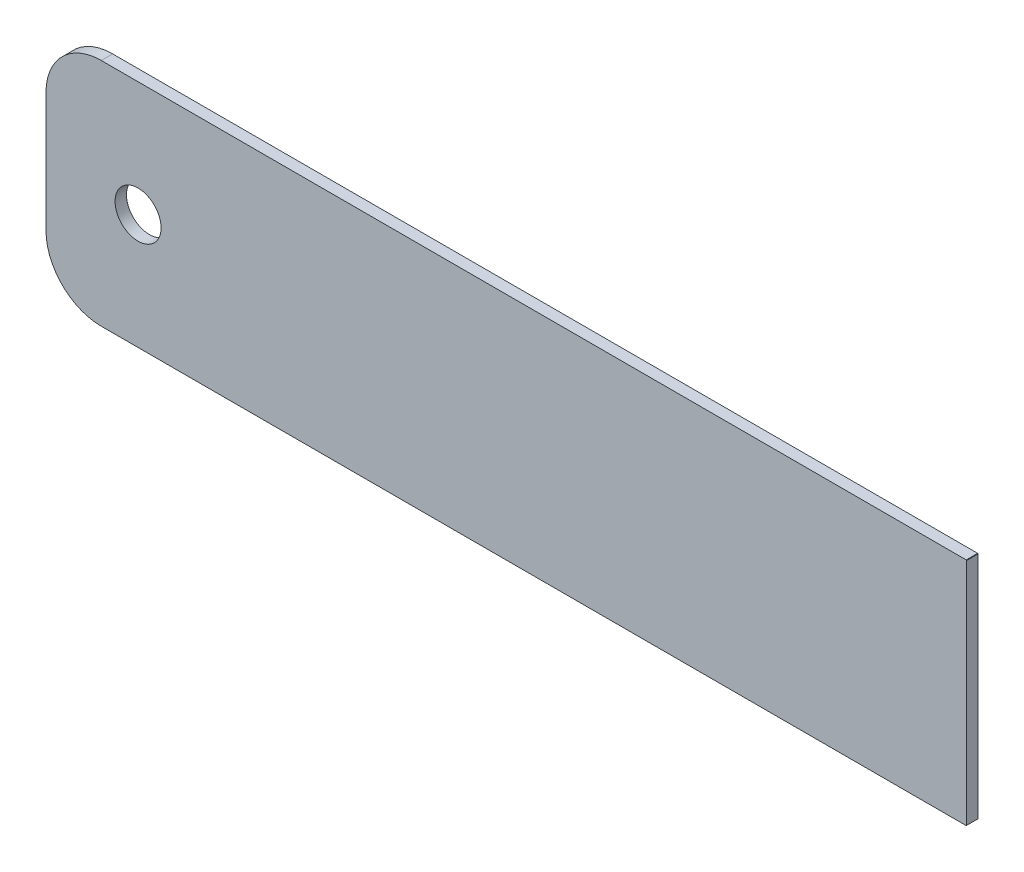
ISO-10303-21;
HEADER;
FILE_DESCRIPTION(('STEP AP214'),'2;1');
FILE_NAME('part.step','',(''),(''),'','','');
FILE_SCHEMA(('AUTOMOTIVE_DESIGN { 1 0 10303 214 1 1 1 1 }'));
ENDSEC;
DATA;
#1=APPLICATION_CONTEXT('core data for automotive mechanical design processes');
#2=APPLICATION_PROTOCOL_DEFINITION('international standard','automotive_design',2000,#1);
#3=PRODUCT_CONTEXT('',#1,'mechanical');
#4=PRODUCT('Part','Part','',(#3));
#5=PRODUCT_RELATED_PRODUCT_CATEGORY('part','',(#4));
#6=PRODUCT_DEFINITION_FORMATION('','',#4);
#7=PRODUCT_DEFINITION_CONTEXT('part definition',#1,'design');
#8=PRODUCT_DEFINITION('design','',#6,#7);
#9=PRODUCT_DEFINITION_SHAPE('','',#8);
#10=(LENGTH_UNIT() NAMED_UNIT(*) SI_UNIT(.MILLI.,.METRE.));
#11=(NAMED_UNIT(*) PLANE_ANGLE_UNIT() SI_UNIT($,.RADIAN.));
#12=(NAMED_UNIT(*) SI_UNIT($,.STERADIAN.) SOLID_ANGLE_UNIT());
#13=UNCERTAINTY_MEASURE_WITH_UNIT(LENGTH_MEASURE(1.E-05),#10,'distance_accuracy_value','');
#14=(GEOMETRIC_REPRESENTATION_CONTEXT(3) GLOBAL_UNCERTAINTY_ASSIGNED_CONTEXT((#13)) GLOBAL_UNIT_ASSIGNED_CONTEXT((#10,
#11,#12)) REPRESENTATION_CONTEXT('',''));
#15=CARTESIAN_POINT('',(0.,0.,0.));
#16=DIRECTION('',(0.,0.,1.));
#17=DIRECTION('',(1.,0.,0.));
#18=AXIS2_PLACEMENT_3D('',#15,#16,#17);
#19=CARTESIAN_POINT('',(-59.69,12.065,0.7874));
#20=DIRECTION('',(0.,0.,1.));
#21=DIRECTION('',(1.,0.,0.));
#22=AXIS2_PLACEMENT_3D('',#19,#20,#21);
#23=PLANE('',#22);
#24=CARTESIAN_POINT('',(-59.69,12.065,0.7874));
#25=DIRECTION('',(0.,0.,1.));
#26=DIRECTION('',(1.,0.,0.));
#27=AXIS2_PLACEMENT_3D('',#24,#25,#26);
#28=CIRCLE('',#27,3.81);
#29=CARTESIAN_POINT('',(-59.69,15.875,0.7874));
#30=VERTEX_POINT('',#29);
#31=CARTESIAN_POINT('',(-63.5,12.065,0.7874));
#32=VERTEX_POINT('',#31);
#33=EDGE_CURVE('E145',#30,#32,#28,.T.);
#34=ORIENTED_EDGE('',*,*,#33,.T.);
#35=DIRECTION('',(0.,-1.,0.));
#36=VECTOR('',#35,1.);
#37=CARTESIAN_POINT('',(-63.5,3.81000000000002,0.7874));
#38=LINE('',#37,#36);
#39=CARTESIAN_POINT('',(-63.5,3.81000000000002,0.7874));
#40=VERTEX_POINT('',#39);
#41=EDGE_CURVE('E93',#32,#40,#38,.T.);
#42=ORIENTED_EDGE('',*,*,#41,.T.);
#43=CARTESIAN_POINT('',(-59.69,3.80999999999999,0.7874));
#44=DIRECTION('',(0.,0.,1.));
#45=DIRECTION('',(-1.,0.,0.));
#46=AXIS2_PLACEMENT_3D('',#43,#44,#45);
#47=CIRCLE('',#46,3.81);
#48=CARTESIAN_POINT('',(-59.69,0.,0.7874));
#49=VERTEX_POINT('',#48);
#50=EDGE_CURVE('E160',#40,#49,#47,.T.);
#51=ORIENTED_EDGE('',*,*,#50,.T.);
#52=DIRECTION('',(1.,0.,0.));
#53=VECTOR('',#52,1.);
#54=CARTESIAN_POINT('',(-0.0254,0.,0.7874));
#55=LINE('',#54,#53);
#56=CARTESIAN_POINT('',(-0.0254,0.,0.7874));
#57=VERTEX_POINT('',#56);
#58=EDGE_CURVE('E173',#49,#57,#55,.T.);
#59=ORIENTED_EDGE('',*,*,#58,.T.);
#60=DIRECTION('',(0.707106781186549,0.707106781186546,0.));
#61=VECTOR('',#60,1.);
#62=CARTESIAN_POINT('',(-0.0254,0.,0.7874));
#63=LINE('',#62,#61);
#64=CARTESIAN_POINT('',(0.,0.0254,0.7874));
#65=VERTEX_POINT('',#64);
#66=EDGE_CURVE('E112',#57,#65,#63,.T.);
#67=ORIENTED_EDGE('',*,*,#66,.T.);
#68=DIRECTION('',(0.,1.,0.));
#69=VECTOR('',#68,1.);
#70=CARTESIAN_POINT('',(0.,0.0254,0.7874));
#71=LINE('',#70,#69);
#72=CARTESIAN_POINT('',(0.,15.8496,0.7874));
#73=VERTEX_POINT('',#72);
#74=EDGE_CURVE('E106',#65,#73,#71,.T.);
#75=ORIENTED_EDGE('',*,*,#74,.T.);
#76=DIRECTION('',(-0.70710678118657,0.707106781186525,0.));
#77=VECTOR('',#76,1.);
#78=CARTESIAN_POINT('',(0.,15.8496,0.7874));
#79=LINE('',#78,#77);
#80=CARTESIAN_POINT('',(-0.0254,15.875,0.7874));
#81=VERTEX_POINT('',#80);
#82=EDGE_CURVE('E110',#73,#81,#79,.T.);
#83=ORIENTED_EDGE('',*,*,#82,.T.);
#84=DIRECTION('',(-1.,0.,0.));
#85=VECTOR('',#84,1.);
#86=CARTESIAN_POINT('',(-0.0254,15.875,0.7874));
#87=LINE('',#86,#85);
#88=EDGE_CURVE('E50',#81,#30,#87,.T.);
#89=ORIENTED_EDGE('',*,*,#88,.T.);
#90=EDGE_LOOP('',(#34,#42,#51,#59,#67,#75,#83,#89));
#91=FACE_BOUND('',#90,.T.);
#92=CARTESIAN_POINT('',(-57.15,7.9375,0.7874));
#93=DIRECTION('',(0.,0.,1.));
#94=DIRECTION('',(1.,0.,0.));
#95=AXIS2_PLACEMENT_3D('',#92,#93,#94);
#96=CIRCLE('',#95,1.5875);
#97=CARTESIAN_POINT('',(-55.5625,7.9375,0.7874));
#98=VERTEX_POINT('',#97);
#99=EDGE_CURVE('E134',#98,#98,#96,.T.);
#100=ORIENTED_EDGE('',*,*,#99,.F.);
#101=EDGE_LOOP('',(#100));
#102=FACE_BOUND('',#101,.T.);
#103=ADVANCED_FACE('F33',(#91,#102),#23,.T.);
#104=CARTESIAN_POINT('',(-59.69,12.065,0.));
#105=DIRECTION('',(0.,0.,1.));
#106=DIRECTION('',(1.,0.,0.));
#107=AXIS2_PLACEMENT_3D('',#104,#105,#106);
#108=PLANE('',#107);
#109=CARTESIAN_POINT('',(-59.69,12.065,0.));
#110=DIRECTION('',(0.,0.,1.));
#111=DIRECTION('',(1.,0.,0.));
#112=AXIS2_PLACEMENT_3D('',#109,#110,#111);
#113=CIRCLE('',#112,3.81);
#114=CARTESIAN_POINT('',(-59.69,15.875,0.));
#115=VERTEX_POINT('',#114);
#116=CARTESIAN_POINT('',(-63.5,12.065,0.));
#117=VERTEX_POINT('',#116);
#118=EDGE_CURVE('E130',#115,#117,#113,.T.);
#119=ORIENTED_EDGE('',*,*,#118,.F.);
#120=DIRECTION('',(-1.,0.,0.));
#121=VECTOR('',#120,1.);
#122=CARTESIAN_POINT('',(-0.0254,15.875,0.));
#123=LINE('',#122,#121);
#124=CARTESIAN_POINT('',(-0.0254,15.875,0.));
#125=VERTEX_POINT('',#124);
#126=EDGE_CURVE('E85',#125,#115,#123,.T.);
#127=ORIENTED_EDGE('',*,*,#126,.F.);
#128=DIRECTION('',(-0.70710678118657,0.707106781186525,0.));
#129=VECTOR('',#128,1.);
#130=CARTESIAN_POINT('',(0.,15.8496,0.));
#131=LINE('',#130,#129);
#132=CARTESIAN_POINT('',(0.,15.8496,0.));
#133=VERTEX_POINT('',#132);
#134=EDGE_CURVE('E79',#133,#125,#131,.T.);
#135=ORIENTED_EDGE('',*,*,#134,.F.);
#136=DIRECTION('',(0.,1.,0.));
#137=VECTOR('',#136,1.);
#138=CARTESIAN_POINT('',(0.,0.0254,0.));
#139=LINE('',#138,#137);
#140=CARTESIAN_POINT('',(0.,0.0254,0.));
#141=VERTEX_POINT('',#140);
#142=EDGE_CURVE('E120',#141,#133,#139,.T.);
#143=ORIENTED_EDGE('',*,*,#142,.F.);
#144=DIRECTION('',(0.707106781186549,0.707106781186546,0.));
#145=VECTOR('',#144,1.);
#146=CARTESIAN_POINT('',(-0.0254,0.,0.));
#147=LINE('',#146,#145);
#148=CARTESIAN_POINT('',(-0.0254,0.,0.));
#149=VERTEX_POINT('',#148);
#150=EDGE_CURVE('E140',#149,#141,#147,.T.);
#151=ORIENTED_EDGE('',*,*,#150,.F.);
#152=DIRECTION('',(1.,0.,0.));
#153=VECTOR('',#152,1.);
#154=CARTESIAN_POINT('',(-0.0254,0.,0.));
#155=LINE('',#154,#153);
#156=CARTESIAN_POINT('',(-59.69,0.,0.));
#157=VERTEX_POINT('',#156);
#158=EDGE_CURVE('E138',#157,#149,#155,.T.);
#159=ORIENTED_EDGE('',*,*,#158,.F.);
#160=CARTESIAN_POINT('',(-59.69,3.80999999999999,0.));
#161=DIRECTION('',(0.,0.,1.));
#162=DIRECTION('',(-1.,0.,0.));
#163=AXIS2_PLACEMENT_3D('',#160,#161,#162);
#164=CIRCLE('',#163,3.81);
#165=CARTESIAN_POINT('',(-63.5,3.81000000000002,0.));
#166=VERTEX_POINT('',#165);
#167=EDGE_CURVE('E136',#166,#157,#164,.T.);
#168=ORIENTED_EDGE('',*,*,#167,.F.);
#169=DIRECTION('',(0.,-1.,0.));
#170=VECTOR('',#169,1.);
#171=CARTESIAN_POINT('',(-63.5,3.81000000000002,0.));
#172=LINE('',#171,#170);
#173=EDGE_CURVE('E133',#117,#166,#172,.T.);
#174=ORIENTED_EDGE('',*,*,#173,.F.);
#175=EDGE_LOOP('',(#119,#127,#135,#143,#151,#159,#168,#174));
#176=FACE_BOUND('',#175,.T.);
#177=CARTESIAN_POINT('',(-57.15,7.9375,0.));
#178=DIRECTION('',(0.,0.,1.));
#179=DIRECTION('',(1.,0.,0.));
#180=AXIS2_PLACEMENT_3D('',#177,#178,#179);
#181=CIRCLE('',#180,1.5875);
#182=CARTESIAN_POINT('',(-55.5625,7.9375,0.));
#183=VERTEX_POINT('',#182);
#184=EDGE_CURVE('E179',#183,#183,#181,.T.);
#185=ORIENTED_EDGE('',*,*,#184,.T.);
#186=EDGE_LOOP('',(#185));
#187=FACE_BOUND('',#186,.T.);
#188=ADVANCED_FACE('F164',(#176,#187),#108,.F.);
#189=CARTESIAN_POINT('',(-59.69,12.065,0.7874));
#190=DIRECTION('',(0.,0.,-1.));
#191=DIRECTION('',(-1.,0.,0.));
#192=AXIS2_PLACEMENT_3D('',#189,#190,#191);
#193=CYLINDRICAL_SURFACE('',#192,3.81);
#194=ORIENTED_EDGE('',*,*,#118,.T.);
#195=DIRECTION('',(0.,0.,-1.));
#196=VECTOR('',#195,1.);
#197=CARTESIAN_POINT('',(-63.5,12.065,0.7874));
#198=LINE('',#197,#196);
#199=EDGE_CURVE('E11',#32,#117,#198,.T.);
#200=ORIENTED_EDGE('',*,*,#199,.F.);
#201=ORIENTED_EDGE('',*,*,#33,.F.);
#202=DIRECTION('',(0.,0.,-1.));
#203=VECTOR('',#202,1.);
#204=CARTESIAN_POINT('',(-59.69,15.875,0.7874));
#205=LINE('',#204,#203);
#206=EDGE_CURVE('E126',#30,#115,#205,.T.);
#207=ORIENTED_EDGE('',*,*,#206,.T.);
#208=EDGE_LOOP('',(#194,#200,#201,#207));
#209=FACE_BOUND('',#208,.T.);
#210=ADVANCED_FACE('F35',(#209),#193,.T.);
#211=CARTESIAN_POINT('',(-63.5,3.81000000000002,0.7874));
#212=DIRECTION('',(1.,0.,0.));
#213=DIRECTION('',(0.,0.,-1.));
#214=AXIS2_PLACEMENT_3D('',#211,#212,#213);
#215=PLANE('',#214);
#216=ORIENTED_EDGE('',*,*,#173,.T.);
#217=DIRECTION('',(0.,0.,-1.));
#218=VECTOR('',#217,1.);
#219=CARTESIAN_POINT('',(-63.5,3.81000000000002,0.7874));
#220=LINE('',#219,#218);
#221=EDGE_CURVE('E42',#40,#166,#220,.T.);
#222=ORIENTED_EDGE('',*,*,#221,.F.);
#223=ORIENTED_EDGE('',*,*,#41,.F.);
#224=ORIENTED_EDGE('',*,*,#199,.T.);
#225=EDGE_LOOP('',(#216,#222,#223,#224));
#226=FACE_BOUND('',#225,.T.);
#227=ADVANCED_FACE('F207',(#226),#215,.F.);
#228=CARTESIAN_POINT('',(-59.69,3.80999999999999,0.7874));
#229=DIRECTION('',(0.,0.,-1.));
#230=DIRECTION('',(-1.,0.,0.));
#231=AXIS2_PLACEMENT_3D('',#228,#229,#230);
#232=CYLINDRICAL_SURFACE('',#231,3.81);
#233=ORIENTED_EDGE('',*,*,#167,.T.);
#234=DIRECTION('',(0.,0.,-1.));
#235=VECTOR('',#234,1.);
#236=CARTESIAN_POINT('',(-59.69,0.,0.7874));
#237=LINE('',#236,#235);
#238=EDGE_CURVE('E152',#49,#157,#237,.T.);
#239=ORIENTED_EDGE('',*,*,#238,.F.);
#240=ORIENTED_EDGE('',*,*,#50,.F.);
#241=ORIENTED_EDGE('',*,*,#221,.T.);
#242=EDGE_LOOP('',(#233,#239,#240,#241));
#243=FACE_BOUND('',#242,.T.);
#244=ADVANCED_FACE('F158',(#243),#232,.T.);
#245=CARTESIAN_POINT('',(-0.0254,0.,0.7874));
#246=DIRECTION('',(0.,1.,0.));
#247=DIRECTION('',(-1.,0.,0.));
#248=AXIS2_PLACEMENT_3D('',#245,#246,#247);
#249=PLANE('',#248);
#250=ORIENTED_EDGE('',*,*,#158,.T.);
#251=DIRECTION('',(0.,0.,-1.));
#252=VECTOR('',#251,1.);
#253=CARTESIAN_POINT('',(-0.0254,0.,0.7874));
#254=LINE('',#253,#252);
#255=EDGE_CURVE('E149',#57,#149,#254,.T.);
#256=ORIENTED_EDGE('',*,*,#255,.F.);
#257=ORIENTED_EDGE('',*,*,#58,.F.);
#258=ORIENTED_EDGE('',*,*,#238,.T.);
#259=EDGE_LOOP('',(#250,#256,#257,#258));
#260=FACE_BOUND('',#259,.T.);
#261=ADVANCED_FACE('F169',(#260),#249,.F.);
#262=CARTESIAN_POINT('',(-0.0254,0.,0.7874));
#263=DIRECTION('',(-0.707106781186546,0.707106781186549,0.));
#264=DIRECTION('',(-0.707106781186549,-0.707106781186546,0.));
#265=AXIS2_PLACEMENT_3D('',#262,#263,#264);
#266=PLANE('',#265);
#267=ORIENTED_EDGE('',*,*,#150,.T.);
#268=DIRECTION('',(0.,0.,-1.));
#269=VECTOR('',#268,1.);
#270=CARTESIAN_POINT('',(0.,0.0254,0.7874));
#271=LINE('',#270,#269);
#272=EDGE_CURVE('E121',#65,#141,#271,.T.);
#273=ORIENTED_EDGE('',*,*,#272,.F.);
#274=ORIENTED_EDGE('',*,*,#66,.F.);
#275=ORIENTED_EDGE('',*,*,#255,.T.);
#276=EDGE_LOOP('',(#267,#273,#274,#275));
#277=FACE_BOUND('',#276,.T.);
#278=ADVANCED_FACE('F172',(#277),#266,.F.);
#279=CARTESIAN_POINT('',(0.,0.0254,0.7874));
#280=DIRECTION('',(-1.,0.,0.));
#281=DIRECTION('',(0.,0.,1.));
#282=AXIS2_PLACEMENT_3D('',#279,#280,#281);
#283=PLANE('',#282);
#284=ORIENTED_EDGE('',*,*,#142,.T.);
#285=DIRECTION('',(0.,0.,-1.));
#286=VECTOR('',#285,1.);
#287=CARTESIAN_POINT('',(0.,15.8496,0.7874));
#288=LINE('',#287,#286);
#289=EDGE_CURVE('E117',#73,#133,#288,.T.);
#290=ORIENTED_EDGE('',*,*,#289,.F.);
#291=ORIENTED_EDGE('',*,*,#74,.F.);
#292=ORIENTED_EDGE('',*,*,#272,.T.);
#293=EDGE_LOOP('',(#284,#290,#291,#292));
#294=FACE_BOUND('',#293,.T.);
#295=ADVANCED_FACE('F118',(#294),#283,.F.);
#296=CARTESIAN_POINT('',(0.,15.8496,0.7874));
#297=DIRECTION('',(-0.707106781186525,-0.70710678118657,0.));
#298=DIRECTION('',(0.70710678118657,-0.707106781186525,0.));
#299=AXIS2_PLACEMENT_3D('',#296,#297,#298);
#300=PLANE('',#299);
#301=ORIENTED_EDGE('',*,*,#134,.T.);
#302=DIRECTION('',(0.,0.,-1.));
#303=VECTOR('',#302,1.);
#304=CARTESIAN_POINT('',(-0.0254,15.875,0.7874));
#305=LINE('',#304,#303);
#306=EDGE_CURVE('E122',#81,#125,#305,.T.);
#307=ORIENTED_EDGE('',*,*,#306,.F.);
#308=ORIENTED_EDGE('',*,*,#82,.F.);
#309=ORIENTED_EDGE('',*,*,#289,.T.);
#310=EDGE_LOOP('',(#301,#307,#308,#309));
#311=FACE_BOUND('',#310,.T.);
#312=ADVANCED_FACE('F124',(#311),#300,.F.);
#313=CARTESIAN_POINT('',(-0.0254,15.875,0.7874));
#314=DIRECTION('',(0.,-1.,0.));
#315=DIRECTION('',(1.,0.,0.));
#316=AXIS2_PLACEMENT_3D('',#313,#314,#315);
#317=PLANE('',#316);
#318=ORIENTED_EDGE('',*,*,#126,.T.);
#319=ORIENTED_EDGE('',*,*,#206,.F.);
#320=ORIENTED_EDGE('',*,*,#88,.F.);
#321=ORIENTED_EDGE('',*,*,#306,.T.);
#322=EDGE_LOOP('',(#318,#319,#320,#321));
#323=FACE_BOUND('',#322,.T.);
#324=ADVANCED_FACE('F195',(#323),#317,.F.);
#325=CARTESIAN_POINT('',(-57.15,7.9375,0.7874));
#326=DIRECTION('',(0.,0.,-1.));
#327=DIRECTION('',(-1.,0.,0.));
#328=AXIS2_PLACEMENT_3D('',#325,#326,#327);
#329=CYLINDRICAL_SURFACE('',#328,1.5875);
#330=ORIENTED_EDGE('',*,*,#99,.T.);
#331=EDGE_LOOP('',(#330));
#332=FACE_BOUND('',#331,.T.);
#333=ORIENTED_EDGE('',*,*,#184,.F.);
#334=EDGE_LOOP('',(#333));
#335=FACE_BOUND('',#334,.T.);
#336=ADVANCED_FACE('F185',(#332,#335),#329,.F.);
#337=CLOSED_SHELL('',(#103,#188,#210,#227,#244,#261,#278,#295,#312,#324,#336));
#338=MANIFOLD_SOLID_BREP('B2',#337);
#339=ADVANCED_BREP_SHAPE_REPRESENTATION('',(#18,#338),#14);
#340=SHAPE_DEFINITION_REPRESENTATION(#9,#339);
ENDSEC;
END-ISO-10303-21;
